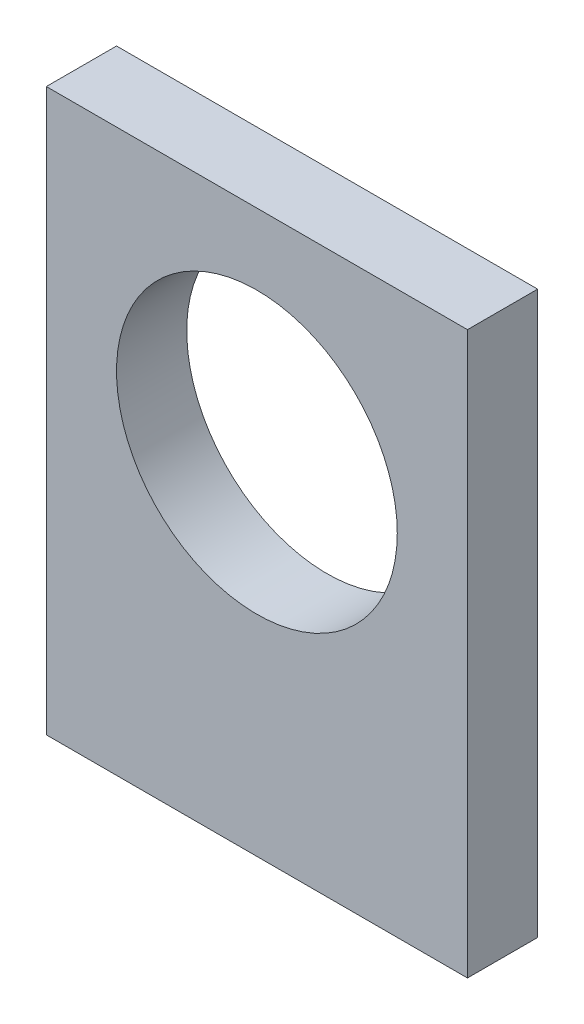
ISO-10303-21;
HEADER;
FILE_DESCRIPTION(('STEP AP214'),'2;1');
FILE_NAME('part.step','',(''),(''),'','','');
FILE_SCHEMA(('AUTOMOTIVE_DESIGN { 1 0 10303 214 1 1 1 1 }'));
ENDSEC;
DATA;
#1=APPLICATION_CONTEXT('core data for automotive mechanical design processes');
#2=APPLICATION_PROTOCOL_DEFINITION('international standard','automotive_design',2000,#1);
#3=PRODUCT_CONTEXT('',#1,'mechanical');
#4=PRODUCT('Part','Part','',(#3));
#5=PRODUCT_RELATED_PRODUCT_CATEGORY('part','',(#4));
#6=PRODUCT_DEFINITION_FORMATION('','',#4);
#7=PRODUCT_DEFINITION_CONTEXT('part definition',#1,'design');
#8=PRODUCT_DEFINITION('design','',#6,#7);
#9=PRODUCT_DEFINITION_SHAPE('','',#8);
#10=(LENGTH_UNIT() NAMED_UNIT(*) SI_UNIT(.MILLI.,.METRE.));
#11=(NAMED_UNIT(*) PLANE_ANGLE_UNIT() SI_UNIT($,.RADIAN.));
#12=(NAMED_UNIT(*) SI_UNIT($,.STERADIAN.) SOLID_ANGLE_UNIT());
#13=UNCERTAINTY_MEASURE_WITH_UNIT(LENGTH_MEASURE(1.E-05),#10,'distance_accuracy_value','');
#14=(GEOMETRIC_REPRESENTATION_CONTEXT(3) GLOBAL_UNCERTAINTY_ASSIGNED_CONTEXT((#13)) GLOBAL_UNIT_ASSIGNED_CONTEXT((#10,
#11,#12)) REPRESENTATION_CONTEXT('',''));
#15=CARTESIAN_POINT('',(0.,0.,0.));
#16=DIRECTION('',(0.,0.,1.));
#17=DIRECTION('',(1.,0.,0.));
#18=AXIS2_PLACEMENT_3D('',#15,#16,#17);
#19=CARTESIAN_POINT('',(0.,0.,5.));
#20=DIRECTION('',(0.,0.,-1.));
#21=DIRECTION('',(-1.,0.,0.));
#22=AXIS2_PLACEMENT_3D('',#19,#20,#21);
#23=PLANE('',#22);
#24=DIRECTION('',(0.,1.,0.));
#25=VECTOR('',#24,1.);
#26=CARTESIAN_POINT('',(15.,-20.,5.));
#27=LINE('',#26,#25);
#28=CARTESIAN_POINT('',(15.,-20.,5.));
#29=VERTEX_POINT('',#28);
#30=CARTESIAN_POINT('',(15.,20.,5.));
#31=VERTEX_POINT('',#30);
#32=EDGE_CURVE('E85',#29,#31,#27,.T.);
#33=ORIENTED_EDGE('',*,*,#32,.T.);
#34=DIRECTION('',(-1.,0.,0.));
#35=VECTOR('',#34,1.);
#36=CARTESIAN_POINT('',(-15.,20.,5.));
#37=LINE('',#36,#35);
#38=CARTESIAN_POINT('',(-15.,20.,5.));
#39=VERTEX_POINT('',#38);
#40=EDGE_CURVE('E80',#31,#39,#37,.T.);
#41=ORIENTED_EDGE('',*,*,#40,.T.);
#42=DIRECTION('',(0.,-1.,0.));
#43=VECTOR('',#42,1.);
#44=CARTESIAN_POINT('',(-15.,-20.,5.));
#45=LINE('',#44,#43);
#46=CARTESIAN_POINT('',(-15.,-20.,5.));
#47=VERTEX_POINT('',#46);
#48=EDGE_CURVE('E83',#39,#47,#45,.T.);
#49=ORIENTED_EDGE('',*,*,#48,.T.);
#50=DIRECTION('',(1.,0.,0.));
#51=VECTOR('',#50,1.);
#52=CARTESIAN_POINT('',(-15.,-20.,5.));
#53=LINE('',#52,#51);
#54=EDGE_CURVE('E50',#47,#29,#53,.T.);
#55=ORIENTED_EDGE('',*,*,#54,.T.);
#56=EDGE_LOOP('',(#33,#41,#49,#55));
#57=FACE_BOUND('',#56,.T.);
#58=CARTESIAN_POINT('',(0.,4.93880077692666,5.));
#59=DIRECTION('',(0.,0.,1.));
#60=DIRECTION('',(1.,0.,0.));
#61=AXIS2_PLACEMENT_3D('',#58,#59,#60);
#62=CIRCLE('',#61,10.);
#63=CARTESIAN_POINT('',(10.,4.93880077692666,5.));
#64=VERTEX_POINT('',#63);
#65=EDGE_CURVE('E100',#64,#64,#62,.T.);
#66=ORIENTED_EDGE('',*,*,#65,.F.);
#67=EDGE_LOOP('',(#66));
#68=FACE_BOUND('',#67,.T.);
#69=ADVANCED_FACE('F33',(#57,#68),#23,.F.);
#70=CARTESIAN_POINT('',(0.,0.,0.));
#71=DIRECTION('',(0.,0.,-1.));
#72=DIRECTION('',(-1.,0.,0.));
#73=AXIS2_PLACEMENT_3D('',#70,#71,#72);
#74=PLANE('',#73);
#75=DIRECTION('',(0.,1.,0.));
#76=VECTOR('',#75,1.);
#77=CARTESIAN_POINT('',(15.,-20.,0.));
#78=LINE('',#77,#76);
#79=CARTESIAN_POINT('',(15.,-20.,0.));
#80=VERTEX_POINT('',#79);
#81=CARTESIAN_POINT('',(15.,20.,0.));
#82=VERTEX_POINT('',#81);
#83=EDGE_CURVE('E97',#80,#82,#78,.T.);
#84=ORIENTED_EDGE('',*,*,#83,.F.);
#85=DIRECTION('',(1.,0.,0.));
#86=VECTOR('',#85,1.);
#87=CARTESIAN_POINT('',(-15.,-20.,0.));
#88=LINE('',#87,#86);
#89=CARTESIAN_POINT('',(-15.,-20.,0.));
#90=VERTEX_POINT('',#89);
#91=EDGE_CURVE('E73',#90,#80,#88,.T.);
#92=ORIENTED_EDGE('',*,*,#91,.F.);
#93=DIRECTION('',(0.,-1.,0.));
#94=VECTOR('',#93,1.);
#95=CARTESIAN_POINT('',(-15.,-20.,0.));
#96=LINE('',#95,#94);
#97=CARTESIAN_POINT('',(-15.,20.,0.));
#98=VERTEX_POINT('',#97);
#99=EDGE_CURVE('E67',#98,#90,#96,.T.);
#100=ORIENTED_EDGE('',*,*,#99,.F.);
#101=DIRECTION('',(-1.,0.,0.));
#102=VECTOR('',#101,1.);
#103=CARTESIAN_POINT('',(-15.,20.,0.));
#104=LINE('',#103,#102);
#105=EDGE_CURVE('E89',#82,#98,#104,.T.);
#106=ORIENTED_EDGE('',*,*,#105,.F.);
#107=EDGE_LOOP('',(#84,#92,#100,#106));
#108=FACE_BOUND('',#107,.T.);
#109=CARTESIAN_POINT('',(0.,4.93880077692666,0.));
#110=DIRECTION('',(0.,0.,1.));
#111=DIRECTION('',(1.,0.,0.));
#112=AXIS2_PLACEMENT_3D('',#109,#110,#111);
#113=CIRCLE('',#112,10.);
#114=CARTESIAN_POINT('',(10.,4.93880077692666,0.));
#115=VERTEX_POINT('',#114);
#116=EDGE_CURVE('E112',#115,#115,#113,.T.);
#117=ORIENTED_EDGE('',*,*,#116,.T.);
#118=EDGE_LOOP('',(#117));
#119=FACE_BOUND('',#118,.T.);
#120=ADVANCED_FACE('F108',(#108,#119),#74,.T.);
#121=CARTESIAN_POINT('',(15.,-20.,5.));
#122=DIRECTION('',(-1.,0.,0.));
#123=DIRECTION('',(0.,-1.,0.));
#124=AXIS2_PLACEMENT_3D('',#121,#122,#123);
#125=PLANE('',#124);
#126=ORIENTED_EDGE('',*,*,#83,.T.);
#127=DIRECTION('',(0.,0.,-1.));
#128=VECTOR('',#127,1.);
#129=CARTESIAN_POINT('',(15.,20.,5.));
#130=LINE('',#129,#128);
#131=EDGE_CURVE('E11',#31,#82,#130,.T.);
#132=ORIENTED_EDGE('',*,*,#131,.F.);
#133=ORIENTED_EDGE('',*,*,#32,.F.);
#134=DIRECTION('',(0.,0.,-1.));
#135=VECTOR('',#134,1.);
#136=CARTESIAN_POINT('',(15.,-20.,5.));
#137=LINE('',#136,#135);
#138=EDGE_CURVE('E93',#29,#80,#137,.T.);
#139=ORIENTED_EDGE('',*,*,#138,.T.);
#140=EDGE_LOOP('',(#126,#132,#133,#139));
#141=FACE_BOUND('',#140,.T.);
#142=ADVANCED_FACE('F35',(#141),#125,.F.);
#143=CARTESIAN_POINT('',(-15.,20.,5.));
#144=DIRECTION('',(0.,-1.,0.));
#145=DIRECTION('',(1.,0.,0.));
#146=AXIS2_PLACEMENT_3D('',#143,#144,#145);
#147=PLANE('',#146);
#148=ORIENTED_EDGE('',*,*,#105,.T.);
#149=DIRECTION('',(0.,0.,-1.));
#150=VECTOR('',#149,1.);
#151=CARTESIAN_POINT('',(-15.,20.,5.));
#152=LINE('',#151,#150);
#153=EDGE_CURVE('E42',#39,#98,#152,.T.);
#154=ORIENTED_EDGE('',*,*,#153,.F.);
#155=ORIENTED_EDGE('',*,*,#40,.F.);
#156=ORIENTED_EDGE('',*,*,#131,.T.);
#157=EDGE_LOOP('',(#148,#154,#155,#156));
#158=FACE_BOUND('',#157,.T.);
#159=ADVANCED_FACE('F88',(#158),#147,.F.);
#160=CARTESIAN_POINT('',(-15.,-20.,5.));
#161=DIRECTION('',(1.,0.,0.));
#162=DIRECTION('',(0.,0.,-1.));
#163=AXIS2_PLACEMENT_3D('',#160,#161,#162);
#164=PLANE('',#163);
#165=ORIENTED_EDGE('',*,*,#99,.T.);
#166=DIRECTION('',(0.,0.,-1.));
#167=VECTOR('',#166,1.);
#168=CARTESIAN_POINT('',(-15.,-20.,5.));
#169=LINE('',#168,#167);
#170=EDGE_CURVE('E90',#47,#90,#169,.T.);
#171=ORIENTED_EDGE('',*,*,#170,.F.);
#172=ORIENTED_EDGE('',*,*,#48,.F.);
#173=ORIENTED_EDGE('',*,*,#153,.T.);
#174=EDGE_LOOP('',(#165,#171,#172,#173));
#175=FACE_BOUND('',#174,.T.);
#176=ADVANCED_FACE('F91',(#175),#164,.F.);
#177=CARTESIAN_POINT('',(-15.,-20.,5.));
#178=DIRECTION('',(0.,1.,0.));
#179=DIRECTION('',(-1.,0.,0.));
#180=AXIS2_PLACEMENT_3D('',#177,#178,#179);
#181=PLANE('',#180);
#182=ORIENTED_EDGE('',*,*,#91,.T.);
#183=ORIENTED_EDGE('',*,*,#138,.F.);
#184=ORIENTED_EDGE('',*,*,#54,.F.);
#185=ORIENTED_EDGE('',*,*,#170,.T.);
#186=EDGE_LOOP('',(#182,#183,#184,#185));
#187=FACE_BOUND('',#186,.T.);
#188=ADVANCED_FACE('F105',(#187),#181,.F.);
#189=CARTESIAN_POINT('',(0.,4.93880077692666,5.));
#190=DIRECTION('',(0.,0.,-1.));
#191=DIRECTION('',(-1.,0.,0.));
#192=AXIS2_PLACEMENT_3D('',#189,#190,#191);
#193=CYLINDRICAL_SURFACE('',#192,10.);
#194=ORIENTED_EDGE('',*,*,#65,.T.);
#195=EDGE_LOOP('',(#194));
#196=FACE_BOUND('',#195,.T.);
#197=ORIENTED_EDGE('',*,*,#116,.F.);
#198=EDGE_LOOP('',(#197));
#199=FACE_BOUND('',#198,.T.);
#200=ADVANCED_FACE('F118',(#196,#199),#193,.F.);
#201=CLOSED_SHELL('',(#69,#120,#142,#159,#176,#188,#200));
#202=MANIFOLD_SOLID_BREP('B2',#201);
#203=ADVANCED_BREP_SHAPE_REPRESENTATION('',(#18,#202),#14);
#204=SHAPE_DEFINITION_REPRESENTATION(#9,#203);
ENDSEC;
END-ISO-10303-21;
